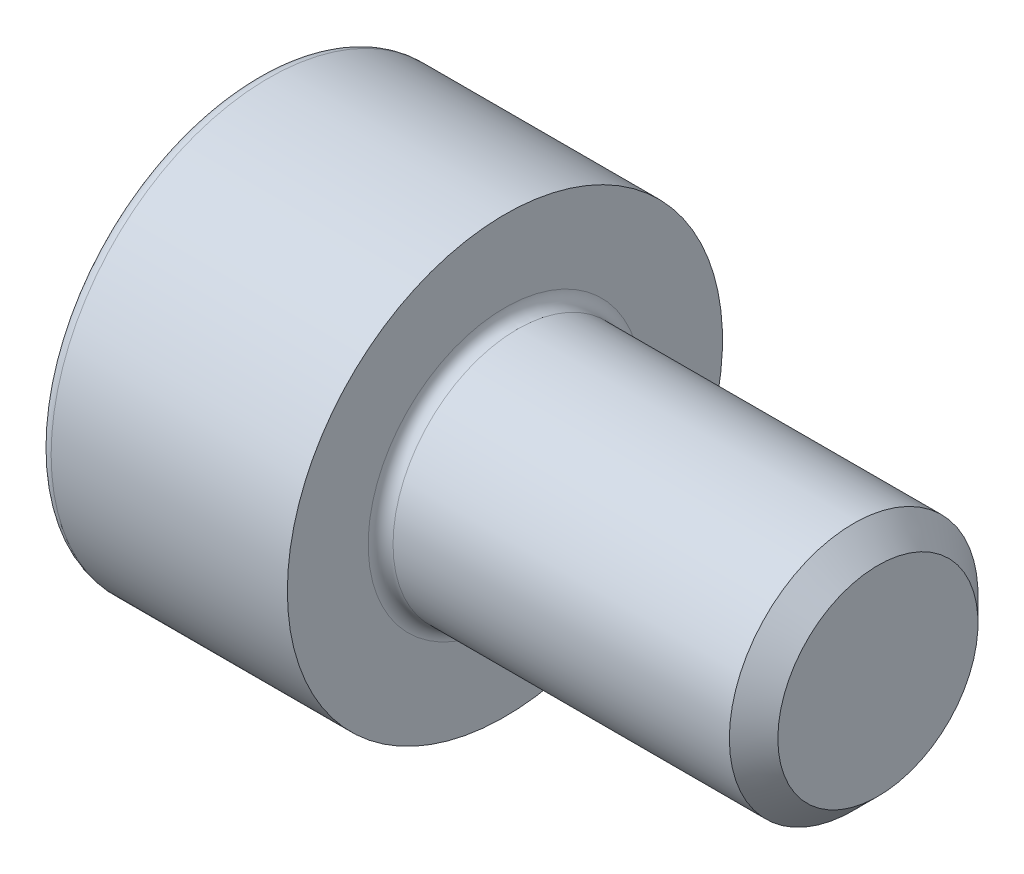
ISO-10303-21;
HEADER;
FILE_DESCRIPTION(('STEP AP214'),'2;1');
FILE_NAME('part.step','',(''),(''),'','','');
FILE_SCHEMA(('AUTOMOTIVE_DESIGN { 1 0 10303 214 1 1 1 1 }'));
ENDSEC;
DATA;
#1=APPLICATION_CONTEXT('core data for automotive mechanical design processes');
#2=APPLICATION_PROTOCOL_DEFINITION('international standard','automotive_design',2000,#1);
#3=PRODUCT_CONTEXT('',#1,'mechanical');
#4=PRODUCT('Part','Part','',(#3));
#5=PRODUCT_RELATED_PRODUCT_CATEGORY('part','',(#4));
#6=PRODUCT_DEFINITION_FORMATION('','',#4);
#7=PRODUCT_DEFINITION_CONTEXT('part definition',#1,'design');
#8=PRODUCT_DEFINITION('design','',#6,#7);
#9=PRODUCT_DEFINITION_SHAPE('','',#8);
#10=(LENGTH_UNIT() NAMED_UNIT(*) SI_UNIT(.MILLI.,.METRE.));
#11=(NAMED_UNIT(*) PLANE_ANGLE_UNIT() SI_UNIT($,.RADIAN.));
#12=(NAMED_UNIT(*) SI_UNIT($,.STERADIAN.) SOLID_ANGLE_UNIT());
#13=UNCERTAINTY_MEASURE_WITH_UNIT(LENGTH_MEASURE(1.E-05),#10,'distance_accuracy_value','');
#14=(GEOMETRIC_REPRESENTATION_CONTEXT(3) GLOBAL_UNCERTAINTY_ASSIGNED_CONTEXT((#13)) GLOBAL_UNIT_ASSIGNED_CONTEXT((#10,
#11,#12)) REPRESENTATION_CONTEXT('',''));
#15=CARTESIAN_POINT('',(0.,0.,0.));
#16=DIRECTION('',(0.,0.,1.));
#17=DIRECTION('',(1.,0.,0.));
#18=AXIS2_PLACEMENT_3D('',#15,#16,#17);
#19=CARTESIAN_POINT('',(0.,0.,0.));
#20=DIRECTION('',(-1.,0.,0.));
#21=DIRECTION('',(0.,0.,1.));
#22=AXIS2_PLACEMENT_3D('',#19,#20,#21);
#23=PLANE('',#22);
#24=DIRECTION('',(0.,-0.499999999999999,0.866025403784439));
#25=VECTOR('',#24,1.);
#26=CARTESIAN_POINT('',(0.,1.77304267668134,0.));
#27=LINE('',#26,#25);
#28=CARTESIAN_POINT('',(0.,1.77304267668134,0.));
#29=VERTEX_POINT('',#28);
#30=CARTESIAN_POINT('',(0.,0.886521338340668,1.5355));
#31=VERTEX_POINT('',#30);
#32=EDGE_CURVE('E259',#29,#31,#27,.T.);
#33=ORIENTED_EDGE('',*,*,#32,.T.);
#34=DIRECTION('',(0.,1.,0.));
#35=VECTOR('',#34,1.);
#36=CARTESIAN_POINT('',(0.,-0.886521338340673,1.5355));
#37=LINE('',#36,#35);
#38=CARTESIAN_POINT('',(0.,-0.886521338340673,1.5355));
#39=VERTEX_POINT('',#38);
#40=EDGE_CURVE('E131',#39,#31,#37,.T.);
#41=ORIENTED_EDGE('',*,*,#40,.F.);
#42=DIRECTION('',(0.,-0.500000000000001,-0.866025403784438));
#43=VECTOR('',#42,1.);
#44=CARTESIAN_POINT('',(0.,-0.886521338340673,1.5355));
#45=LINE('',#44,#43);
#46=CARTESIAN_POINT('',(0.,-1.77304267668135,0.));
#47=VERTEX_POINT('',#46);
#48=EDGE_CURVE('E262',#39,#47,#45,.T.);
#49=ORIENTED_EDGE('',*,*,#48,.T.);
#50=DIRECTION('',(0.,0.499999999999999,-0.866025403784439));
#51=VECTOR('',#50,1.);
#52=CARTESIAN_POINT('',(0.,-1.77304267668135,0.));
#53=LINE('',#52,#51);
#54=CARTESIAN_POINT('',(0.,-0.886521338340677,-1.5355));
#55=VERTEX_POINT('',#54);
#56=EDGE_CURVE('E265',#47,#55,#53,.T.);
#57=ORIENTED_EDGE('',*,*,#56,.T.);
#58=DIRECTION('',(0.,-1.,0.));
#59=VECTOR('',#58,1.);
#60=CARTESIAN_POINT('',(0.,0.886521338340664,-1.5355));
#61=LINE('',#60,#59);
#62=CARTESIAN_POINT('',(0.,0.886521338340664,-1.5355));
#63=VERTEX_POINT('',#62);
#64=EDGE_CURVE('E268',#63,#55,#61,.T.);
#65=ORIENTED_EDGE('',*,*,#64,.F.);
#66=DIRECTION('',(0.,-0.500000000000001,-0.866025403784438));
#67=VECTOR('',#66,1.);
#68=CARTESIAN_POINT('',(0.,1.77304267668134,0.));
#69=LINE('',#68,#67);
#70=EDGE_CURVE('E126',#29,#63,#69,.T.);
#71=ORIENTED_EDGE('',*,*,#70,.F.);
#72=EDGE_LOOP('',(#33,#41,#49,#57,#65,#71));
#73=FACE_BOUND('',#72,.T.);
#74=CARTESIAN_POINT('',(0.,0.,0.));
#75=DIRECTION('',(-1.,0.,0.));
#76=DIRECTION('',(0.,0.,1.));
#77=AXIS2_PLACEMENT_3D('',#74,#75,#76);
#78=CIRCLE('',#77,3.3);
#79=CARTESIAN_POINT('',(0.,0.,3.3));
#80=VERTEX_POINT('',#79);
#81=EDGE_CURVE('E43',#80,#80,#78,.T.);
#82=ORIENTED_EDGE('',*,*,#81,.T.);
#83=EDGE_LOOP('',(#82));
#84=FACE_BOUND('',#83,.T.);
#85=ADVANCED_FACE('F35',(#73,#84),#23,.T.);
#86=CARTESIAN_POINT('',(-31.75,0.,0.));
#87=DIRECTION('',(-1.,0.,0.));
#88=DIRECTION('',(0.,0.,1.));
#89=AXIS2_PLACEMENT_3D('',#86,#87,#88);
#90=CYLINDRICAL_SURFACE('',#89,3.5);
#91=CARTESIAN_POINT('',(0.199999999999999,0.,0.));
#92=DIRECTION('',(-1.,0.,0.));
#93=DIRECTION('',(0.,0.,1.));
#94=AXIS2_PLACEMENT_3D('',#91,#92,#93);
#95=CIRCLE('',#94,3.5);
#96=CARTESIAN_POINT('',(0.199999999999999,0.,3.5));
#97=VERTEX_POINT('',#96);
#98=EDGE_CURVE('E11',#97,#97,#95,.F.);
#99=ORIENTED_EDGE('',*,*,#98,.T.);
#100=EDGE_LOOP('',(#99));
#101=FACE_BOUND('',#100,.T.);
#102=CARTESIAN_POINT('',(4.,0.,0.));
#103=DIRECTION('',(-1.,0.,0.));
#104=DIRECTION('',(0.,0.,1.));
#105=AXIS2_PLACEMENT_3D('',#102,#103,#104);
#106=CIRCLE('',#105,3.5);
#107=CARTESIAN_POINT('',(4.,0.,3.5));
#108=VERTEX_POINT('',#107);
#109=EDGE_CURVE('E149',#108,#108,#106,.T.);
#110=ORIENTED_EDGE('',*,*,#109,.T.);
#111=EDGE_LOOP('',(#110));
#112=FACE_BOUND('',#111,.T.);
#113=ADVANCED_FACE('F173',(#101,#112),#90,.T.);
#114=CARTESIAN_POINT('',(4.,3.5,0.));
#115=DIRECTION('',(1.,0.,0.));
#116=DIRECTION('',(0.,0.,-1.));
#117=AXIS2_PLACEMENT_3D('',#114,#115,#116);
#118=PLANE('',#117);
#119=CARTESIAN_POINT('',(4.,0.,0.));
#120=DIRECTION('',(1.,0.,0.));
#121=DIRECTION('',(0.,0.,-1.));
#122=AXIS2_PLACEMENT_3D('',#119,#120,#121);
#123=CIRCLE('',#122,2.2);
#124=CARTESIAN_POINT('',(4.,0.,-2.2));
#125=VERTEX_POINT('',#124);
#126=EDGE_CURVE('E152',#125,#125,#123,.F.);
#127=ORIENTED_EDGE('',*,*,#126,.T.);
#128=EDGE_LOOP('',(#127));
#129=FACE_BOUND('',#128,.T.);
#130=ORIENTED_EDGE('',*,*,#109,.F.);
#131=EDGE_LOOP('',(#130));
#132=FACE_BOUND('',#131,.T.);
#133=ADVANCED_FACE('F179',(#129,#132),#118,.T.);
#134=CARTESIAN_POINT('',(-31.75,0.,0.));
#135=DIRECTION('',(-1.,0.,0.));
#136=DIRECTION('',(0.,0.,1.));
#137=AXIS2_PLACEMENT_3D('',#134,#135,#136);
#138=CYLINDRICAL_SURFACE('',#137,2.);
#139=CARTESIAN_POINT('',(4.2,0.,0.));
#140=DIRECTION('',(1.,0.,0.));
#141=DIRECTION('',(0.,0.,-1.));
#142=AXIS2_PLACEMENT_3D('',#139,#140,#141);
#143=CIRCLE('',#142,2.);
#144=CARTESIAN_POINT('',(4.2,0.,-2.));
#145=VERTEX_POINT('',#144);
#146=EDGE_CURVE('E155',#145,#145,#143,.T.);
#147=ORIENTED_EDGE('',*,*,#146,.T.);
#148=EDGE_LOOP('',(#147));
#149=FACE_BOUND('',#148,.T.);
#150=CARTESIAN_POINT('',(9.61000000000001,0.,0.));
#151=DIRECTION('',(-1.,0.,0.));
#152=DIRECTION('',(0.,0.,1.));
#153=AXIS2_PLACEMENT_3D('',#150,#151,#152);
#154=CIRCLE('',#153,2.);
#155=CARTESIAN_POINT('',(9.61000000000001,0.,2.));
#156=VERTEX_POINT('',#155);
#157=EDGE_CURVE('E146',#156,#156,#154,.T.);
#158=ORIENTED_EDGE('',*,*,#157,.T.);
#159=EDGE_LOOP('',(#158));
#160=FACE_BOUND('',#159,.T.);
#161=ADVANCED_FACE('F185',(#149,#160),#138,.T.);
#162=CARTESIAN_POINT('',(10.,0.,0.));
#163=DIRECTION('',(-1.,0.,0.));
#164=DIRECTION('',(0.,0.,1.));
#165=AXIS2_PLACEMENT_3D('',#162,#163,#164);
#166=CONICAL_SURFACE('',#165,1.61,0.785398163397465);
#167=ORIENTED_EDGE('',*,*,#157,.F.);
#168=EDGE_LOOP('',(#167));
#169=FACE_BOUND('',#168,.T.);
#170=CARTESIAN_POINT('',(10.,0.,0.));
#171=DIRECTION('',(-1.,0.,0.));
#172=DIRECTION('',(0.,0.,1.));
#173=AXIS2_PLACEMENT_3D('',#170,#171,#172);
#174=CIRCLE('',#173,1.61);
#175=CARTESIAN_POINT('',(10.,0.,1.61));
#176=VERTEX_POINT('',#175);
#177=EDGE_CURVE('E142',#176,#176,#174,.T.);
#178=ORIENTED_EDGE('',*,*,#177,.T.);
#179=EDGE_LOOP('',(#178));
#180=FACE_BOUND('',#179,.T.);
#181=ADVANCED_FACE('F189',(#169,#180),#166,.T.);
#182=CARTESIAN_POINT('',(10.,1.61,0.));
#183=DIRECTION('',(1.,0.,0.));
#184=DIRECTION('',(0.,0.,-1.));
#185=AXIS2_PLACEMENT_3D('',#182,#183,#184);
#186=PLANE('',#185);
#187=ORIENTED_EDGE('',*,*,#177,.F.);
#188=EDGE_LOOP('',(#187));
#189=FACE_BOUND('',#188,.T.);
#190=ADVANCED_FACE('F169',(#189),#186,.T.);
#191=CARTESIAN_POINT('',(4.2,0.,0.));
#192=DIRECTION('',(1.,0.,0.));
#193=DIRECTION('',(0.,0.,-1.));
#194=AXIS2_PLACEMENT_3D('',#191,#192,#193);
#195=TOROIDAL_SURFACE('',#194,2.2,0.2);
#196=ORIENTED_EDGE('',*,*,#146,.F.);
#197=EDGE_LOOP('',(#196));
#198=FACE_BOUND('',#197,.T.);
#199=ORIENTED_EDGE('',*,*,#126,.F.);
#200=EDGE_LOOP('',(#199));
#201=FACE_BOUND('',#200,.T.);
#202=ADVANCED_FACE('F162',(#198,#201),#195,.F.);
#203=CARTESIAN_POINT('',(0.199999999999999,0.,0.));
#204=DIRECTION('',(-1.,0.,0.));
#205=DIRECTION('',(0.,0.,1.));
#206=AXIS2_PLACEMENT_3D('',#203,#204,#205);
#207=TOROIDAL_SURFACE('',#206,3.3,0.2);
#208=ORIENTED_EDGE('',*,*,#98,.F.);
#209=EDGE_LOOP('',(#208));
#210=FACE_BOUND('',#209,.T.);
#211=ORIENTED_EDGE('',*,*,#81,.F.);
#212=EDGE_LOOP('',(#211));
#213=FACE_BOUND('',#212,.T.);
#214=ADVANCED_FACE('F37',(#210,#213),#207,.T.);
#215=CARTESIAN_POINT('',(2.,1.77304267668134,0.));
#216=DIRECTION('',(0.,-0.866025403784439,-0.499999999999999));
#217=DIRECTION('',(0.,0.499999999999999,-0.866025403784439));
#218=AXIS2_PLACEMENT_3D('',#215,#216,#217);
#219=PLANE('',#218);
#220=ORIENTED_EDGE('',*,*,#32,.F.);
#221=DIRECTION('',(-1.,0.,0.));
#222=VECTOR('',#221,1.);
#223=CARTESIAN_POINT('',(2.,1.77304267668134,0.));
#224=LINE('',#223,#222);
#225=CARTESIAN_POINT('',(2.,1.77304267668134,0.));
#226=VERTEX_POINT('',#225);
#227=EDGE_CURVE('E249',#226,#29,#224,.T.);
#228=ORIENTED_EDGE('',*,*,#227,.F.);
#229=DIRECTION('',(0.,-0.499999999999999,0.866025403784439));
#230=VECTOR('',#229,1.);
#231=CARTESIAN_POINT('',(2.,1.77304267668134,0.));
#232=LINE('',#231,#230);
#233=CARTESIAN_POINT('',(2.,1.329782007511,0.767749999999996));
#234=VERTEX_POINT('',#233);
#235=EDGE_CURVE('E118',#226,#234,#232,.T.);
#236=ORIENTED_EDGE('',*,*,#235,.T.);
#237=CARTESIAN_POINT('',(2.,0.886521338340668,1.5355));
#238=VERTEX_POINT('',#237);
#239=EDGE_CURVE('E109',#234,#238,#232,.T.);
#240=ORIENTED_EDGE('',*,*,#239,.T.);
#241=DIRECTION('',(-1.,0.,0.));
#242=VECTOR('',#241,1.);
#243=CARTESIAN_POINT('',(2.,0.886521338340668,1.5355));
#244=LINE('',#243,#242);
#245=EDGE_CURVE('E123',#238,#31,#244,.T.);
#246=ORIENTED_EDGE('',*,*,#245,.T.);
#247=EDGE_LOOP('',(#220,#228,#236,#240,#246));
#248=FACE_BOUND('',#247,.T.);
#249=ADVANCED_FACE('F122',(#248),#219,.T.);
#250=CARTESIAN_POINT('',(2.,-0.886521338340673,1.5355));
#251=DIRECTION('',(0.,0.,1.));
#252=DIRECTION('',(0.,-1.,0.));
#253=AXIS2_PLACEMENT_3D('',#250,#251,#252);
#254=PLANE('',#253);
#255=ORIENTED_EDGE('',*,*,#40,.T.);
#256=ORIENTED_EDGE('',*,*,#245,.F.);
#257=DIRECTION('',(0.,1.,0.));
#258=VECTOR('',#257,1.);
#259=CARTESIAN_POINT('',(2.,-0.886521338340673,1.5355));
#260=LINE('',#259,#258);
#261=CARTESIAN_POINT('',(2.,0.,1.5355));
#262=VERTEX_POINT('',#261);
#263=EDGE_CURVE('E106',#262,#238,#260,.T.);
#264=ORIENTED_EDGE('',*,*,#263,.F.);
#265=CARTESIAN_POINT('',(2.,-0.886521338340673,1.5355));
#266=VERTEX_POINT('',#265);
#267=EDGE_CURVE('E117',#266,#262,#260,.T.);
#268=ORIENTED_EDGE('',*,*,#267,.F.);
#269=DIRECTION('',(-1.,0.,0.));
#270=VECTOR('',#269,1.);
#271=CARTESIAN_POINT('',(2.,-0.886521338340673,1.5355));
#272=LINE('',#271,#270);
#273=EDGE_CURVE('E133',#266,#39,#272,.T.);
#274=ORIENTED_EDGE('',*,*,#273,.T.);
#275=EDGE_LOOP('',(#255,#256,#264,#268,#274));
#276=FACE_BOUND('',#275,.T.);
#277=ADVANCED_FACE('F128',(#276),#254,.F.);
#278=CARTESIAN_POINT('',(2.,-0.886521338340673,1.5355));
#279=DIRECTION('',(0.,0.866025403784438,-0.500000000000001));
#280=DIRECTION('',(0.,0.500000000000001,0.866025403784438));
#281=AXIS2_PLACEMENT_3D('',#278,#279,#280);
#282=PLANE('',#281);
#283=ORIENTED_EDGE('',*,*,#48,.F.);
#284=ORIENTED_EDGE('',*,*,#273,.F.);
#285=DIRECTION('',(0.,-0.500000000000001,-0.866025403784438));
#286=VECTOR('',#285,1.);
#287=CARTESIAN_POINT('',(2.,-0.886521338340673,1.5355));
#288=LINE('',#287,#286);
#289=CARTESIAN_POINT('',(2.,-1.32978200751101,0.767750000000003));
#290=VERTEX_POINT('',#289);
#291=EDGE_CURVE('E288',#266,#290,#288,.T.);
#292=ORIENTED_EDGE('',*,*,#291,.T.);
#293=CARTESIAN_POINT('',(2.,-1.77304267668135,0.));
#294=VERTEX_POINT('',#293);
#295=EDGE_CURVE('E277',#290,#294,#288,.T.);
#296=ORIENTED_EDGE('',*,*,#295,.T.);
#297=DIRECTION('',(-1.,0.,0.));
#298=VECTOR('',#297,1.);
#299=CARTESIAN_POINT('',(2.,-1.77304267668135,0.));
#300=LINE('',#299,#298);
#301=EDGE_CURVE('E138',#294,#47,#300,.T.);
#302=ORIENTED_EDGE('',*,*,#301,.T.);
#303=EDGE_LOOP('',(#283,#284,#292,#296,#302));
#304=FACE_BOUND('',#303,.T.);
#305=ADVANCED_FACE('F203',(#304),#282,.T.);
#306=CARTESIAN_POINT('',(2.,-1.77304267668135,0.));
#307=DIRECTION('',(0.,0.866025403784439,0.499999999999999));
#308=DIRECTION('',(0.,-0.499999999999999,0.866025403784439));
#309=AXIS2_PLACEMENT_3D('',#306,#307,#308);
#310=PLANE('',#309);
#311=ORIENTED_EDGE('',*,*,#56,.F.);
#312=ORIENTED_EDGE('',*,*,#301,.F.);
#313=DIRECTION('',(0.,0.499999999999999,-0.866025403784439));
#314=VECTOR('',#313,1.);
#315=CARTESIAN_POINT('',(2.,-1.77304267668135,0.));
#316=LINE('',#315,#314);
#317=CARTESIAN_POINT('',(2.,-1.32978200751101,-0.767750000000001));
#318=VERTEX_POINT('',#317);
#319=EDGE_CURVE('E255',#294,#318,#316,.T.);
#320=ORIENTED_EDGE('',*,*,#319,.T.);
#321=CARTESIAN_POINT('',(2.,-0.886521338340677,-1.5355));
#322=VERTEX_POINT('',#321);
#323=EDGE_CURVE('E287',#318,#322,#316,.T.);
#324=ORIENTED_EDGE('',*,*,#323,.T.);
#325=DIRECTION('',(-1.,0.,0.));
#326=VECTOR('',#325,1.);
#327=CARTESIAN_POINT('',(2.,-0.886521338340677,-1.5355));
#328=LINE('',#327,#326);
#329=EDGE_CURVE('E248',#322,#55,#328,.T.);
#330=ORIENTED_EDGE('',*,*,#329,.T.);
#331=EDGE_LOOP('',(#311,#312,#320,#324,#330));
#332=FACE_BOUND('',#331,.T.);
#333=ADVANCED_FACE('F206',(#332),#310,.T.);
#334=CARTESIAN_POINT('',(2.,0.886521338340664,-1.5355));
#335=DIRECTION('',(0.,0.,-1.));
#336=DIRECTION('',(0.,1.,0.));
#337=AXIS2_PLACEMENT_3D('',#334,#335,#336);
#338=PLANE('',#337);
#339=ORIENTED_EDGE('',*,*,#64,.T.);
#340=ORIENTED_EDGE('',*,*,#329,.F.);
#341=DIRECTION('',(0.,-1.,0.));
#342=VECTOR('',#341,1.);
#343=CARTESIAN_POINT('',(2.,0.886521338340664,-1.5355));
#344=LINE('',#343,#342);
#345=CARTESIAN_POINT('',(2.,0.,-1.5355));
#346=VERTEX_POINT('',#345);
#347=EDGE_CURVE('E252',#346,#322,#344,.T.);
#348=ORIENTED_EDGE('',*,*,#347,.F.);
#349=CARTESIAN_POINT('',(2.,0.886521338340664,-1.5355));
#350=VERTEX_POINT('',#349);
#351=EDGE_CURVE('E50',#350,#346,#344,.T.);
#352=ORIENTED_EDGE('',*,*,#351,.F.);
#353=DIRECTION('',(-1.,0.,0.));
#354=VECTOR('',#353,1.);
#355=CARTESIAN_POINT('',(2.,0.886521338340664,-1.5355));
#356=LINE('',#355,#354);
#357=EDGE_CURVE('E245',#350,#63,#356,.T.);
#358=ORIENTED_EDGE('',*,*,#357,.T.);
#359=EDGE_LOOP('',(#339,#340,#348,#352,#358));
#360=FACE_BOUND('',#359,.T.);
#361=ADVANCED_FACE('F210',(#360),#338,.F.);
#362=CARTESIAN_POINT('',(2.,1.77304267668134,0.));
#363=DIRECTION('',(0.,0.866025403784438,-0.500000000000001));
#364=DIRECTION('',(0.,0.500000000000001,0.866025403784438));
#365=AXIS2_PLACEMENT_3D('',#362,#363,#364);
#366=PLANE('',#365);
#367=ORIENTED_EDGE('',*,*,#70,.T.);
#368=ORIENTED_EDGE('',*,*,#357,.F.);
#369=DIRECTION('',(0.,-0.500000000000001,-0.866025403784438));
#370=VECTOR('',#369,1.);
#371=CARTESIAN_POINT('',(2.,1.77304267668134,0.));
#372=LINE('',#371,#370);
#373=CARTESIAN_POINT('',(2.,1.329782007511,-0.767750000000001));
#374=VERTEX_POINT('',#373);
#375=EDGE_CURVE('E235',#374,#350,#372,.T.);
#376=ORIENTED_EDGE('',*,*,#375,.F.);
#377=EDGE_CURVE('E241',#226,#374,#372,.T.);
#378=ORIENTED_EDGE('',*,*,#377,.F.);
#379=ORIENTED_EDGE('',*,*,#227,.T.);
#380=EDGE_LOOP('',(#367,#368,#376,#378,#379));
#381=FACE_BOUND('',#380,.T.);
#382=ADVANCED_FACE('F214',(#381),#366,.F.);
#383=CARTESIAN_POINT('',(2.,1.77304267668134,0.));
#384=DIRECTION('',(1.,0.,0.));
#385=DIRECTION('',(0.,0.,-1.));
#386=AXIS2_PLACEMENT_3D('',#383,#384,#385);
#387=PLANE('',#386);
#388=ORIENTED_EDGE('',*,*,#347,.T.);
#389=ORIENTED_EDGE('',*,*,#323,.F.);
#390=CARTESIAN_POINT('',(2.,0.,0.));
#391=DIRECTION('',(-1.,0.,0.));
#392=DIRECTION('',(0.,0.,1.));
#393=AXIS2_PLACEMENT_3D('',#390,#391,#392);
#394=CIRCLE('',#393,1.5355);
#395=EDGE_CURVE('E283',#346,#318,#394,.T.);
#396=ORIENTED_EDGE('',*,*,#395,.F.);
#397=EDGE_LOOP('',(#388,#389,#396));
#398=FACE_BOUND('',#397,.T.);
#399=ADVANCED_FACE('F218',(#398),#387,.F.);
#400=ORIENTED_EDGE('',*,*,#319,.F.);
#401=ORIENTED_EDGE('',*,*,#295,.F.);
#402=EDGE_CURVE('E136',#318,#290,#394,.T.);
#403=ORIENTED_EDGE('',*,*,#402,.F.);
#404=EDGE_LOOP('',(#400,#401,#403));
#405=FACE_BOUND('',#404,.T.);
#406=ADVANCED_FACE('F221',(#405),#387,.F.);
#407=ORIENTED_EDGE('',*,*,#291,.F.);
#408=ORIENTED_EDGE('',*,*,#267,.T.);
#409=EDGE_CURVE('E132',#290,#262,#394,.T.);
#410=ORIENTED_EDGE('',*,*,#409,.F.);
#411=EDGE_LOOP('',(#407,#408,#410));
#412=FACE_BOUND('',#411,.T.);
#413=ADVANCED_FACE('F226',(#412),#387,.F.);
#414=ORIENTED_EDGE('',*,*,#263,.T.);
#415=ORIENTED_EDGE('',*,*,#239,.F.);
#416=EDGE_CURVE('E112',#262,#234,#394,.T.);
#417=ORIENTED_EDGE('',*,*,#416,.F.);
#418=EDGE_LOOP('',(#414,#415,#417));
#419=FACE_BOUND('',#418,.T.);
#420=ADVANCED_FACE('F108',(#419),#387,.F.);
#421=ORIENTED_EDGE('',*,*,#235,.F.);
#422=ORIENTED_EDGE('',*,*,#377,.T.);
#423=EDGE_CURVE('E143',#234,#374,#394,.T.);
#424=ORIENTED_EDGE('',*,*,#423,.F.);
#425=EDGE_LOOP('',(#421,#422,#424));
#426=FACE_BOUND('',#425,.T.);
#427=ADVANCED_FACE('F229',(#426),#387,.F.);
#428=ORIENTED_EDGE('',*,*,#375,.T.);
#429=ORIENTED_EDGE('',*,*,#351,.T.);
#430=EDGE_CURVE('E238',#374,#346,#394,.T.);
#431=ORIENTED_EDGE('',*,*,#430,.F.);
#432=EDGE_LOOP('',(#428,#429,#431));
#433=FACE_BOUND('',#432,.T.);
#434=ADVANCED_FACE('F199',(#433),#387,.F.);
#435=CARTESIAN_POINT('',(2.,0.,0.));
#436=DIRECTION('',(-1.,0.,0.));
#437=DIRECTION('',(0.,0.,1.));
#438=AXIS2_PLACEMENT_3D('',#435,#436,#437);
#439=CONICAL_SURFACE('',#438,1.5355,1.04719755119659);
#440=CARTESIAN_POINT('',(2.88652133834068,0.,0.));
#441=VERTEX_POINT('',#440);
#442=VERTEX_LOOP('',#441);
#443=FACE_BOUND('',#442,.T.);
#444=ORIENTED_EDGE('',*,*,#416,.T.);
#445=ORIENTED_EDGE('',*,*,#423,.T.);
#446=ORIENTED_EDGE('',*,*,#430,.T.);
#447=ORIENTED_EDGE('',*,*,#395,.T.);
#448=ORIENTED_EDGE('',*,*,#402,.T.);
#449=ORIENTED_EDGE('',*,*,#409,.T.);
#450=EDGE_LOOP('',(#444,#445,#446,#447,#448,#449));
#451=FACE_BOUND('',#450,.T.);
#452=ADVANCED_FACE('F197',(#443,#451),#439,.F.);
#453=CLOSED_SHELL('',(#85,#113,#133,#161,#181,#190,#202,#214,#249,#277,#305,#333,#361,#382,#399,
#406,#413,#420,#427,#434,#452));
#454=MANIFOLD_SOLID_BREP('B2',#453);
#455=ADVANCED_BREP_SHAPE_REPRESENTATION('',(#18,#454),#14);
#456=SHAPE_DEFINITION_REPRESENTATION(#9,#455);
ENDSEC;
END-ISO-10303-21;
